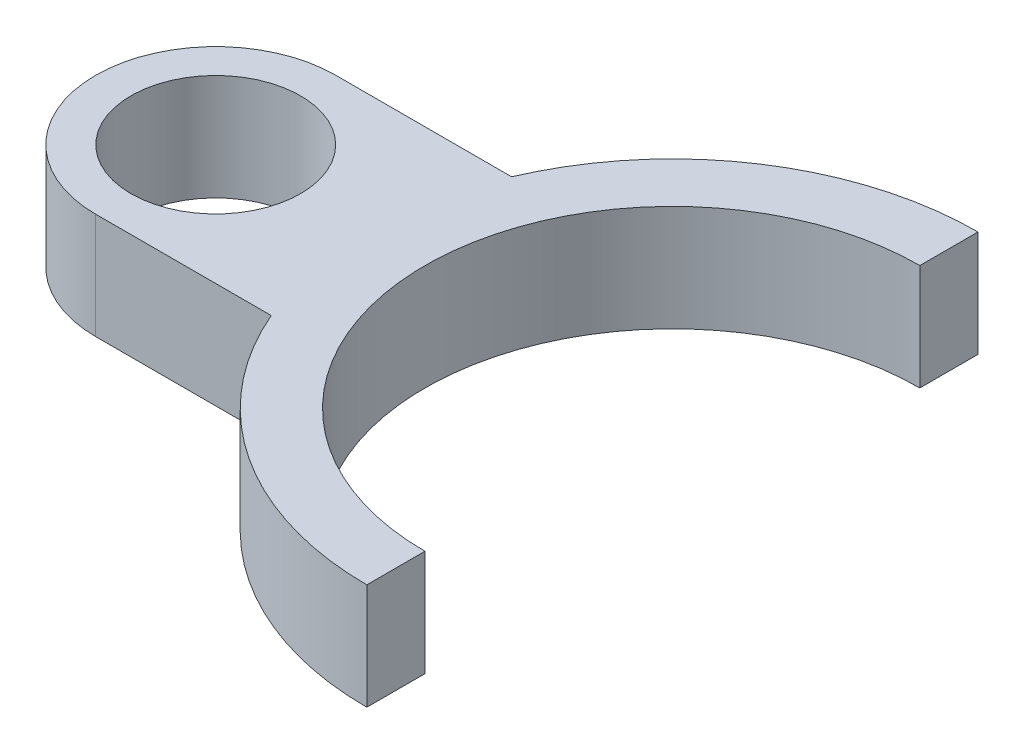
ISO-10303-21;
HEADER;
FILE_DESCRIPTION(('STEP AP214'),'2;1');
FILE_NAME('part.step','',(''),(''),'','','');
FILE_SCHEMA(('AUTOMOTIVE_DESIGN { 1 0 10303 214 1 1 1 1 }'));
ENDSEC;
DATA;
#1=APPLICATION_CONTEXT('core data for automotive mechanical design processes');
#2=APPLICATION_PROTOCOL_DEFINITION('international standard','automotive_design',2000,#1);
#3=PRODUCT_CONTEXT('',#1,'mechanical');
#4=PRODUCT('Part','Part','',(#3));
#5=PRODUCT_RELATED_PRODUCT_CATEGORY('part','',(#4));
#6=PRODUCT_DEFINITION_FORMATION('','',#4);
#7=PRODUCT_DEFINITION_CONTEXT('part definition',#1,'design');
#8=PRODUCT_DEFINITION('design','',#6,#7);
#9=PRODUCT_DEFINITION_SHAPE('','',#8);
#10=(LENGTH_UNIT() NAMED_UNIT(*) SI_UNIT(.MILLI.,.METRE.));
#11=(NAMED_UNIT(*) PLANE_ANGLE_UNIT() SI_UNIT($,.RADIAN.));
#12=(NAMED_UNIT(*) SI_UNIT($,.STERADIAN.) SOLID_ANGLE_UNIT());
#13=UNCERTAINTY_MEASURE_WITH_UNIT(LENGTH_MEASURE(1.E-05),#10,'distance_accuracy_value','');
#14=(GEOMETRIC_REPRESENTATION_CONTEXT(3) GLOBAL_UNCERTAINTY_ASSIGNED_CONTEXT((#13)) GLOBAL_UNIT_ASSIGNED_CONTEXT((#10,
#11,#12)) REPRESENTATION_CONTEXT('',''));
#15=CARTESIAN_POINT('',(0.,0.,0.));
#16=DIRECTION('',(0.,0.,1.));
#17=DIRECTION('',(1.,0.,0.));
#18=AXIS2_PLACEMENT_3D('',#15,#16,#17);
#19=CARTESIAN_POINT('',(0.,15.,0.));
#20=DIRECTION('',(0.,1.,0.));
#21=DIRECTION('',(0.,0.,1.));
#22=AXIS2_PLACEMENT_3D('',#19,#20,#21);
#23=PLANE('',#22);
#24=CARTESIAN_POINT('',(64.5980357278133,15.,0.));
#25=DIRECTION('',(0.,-1.,0.));
#26=DIRECTION('',(0.,0.,-1.));
#27=AXIS2_PLACEMENT_3D('',#24,#25,#26);
#28=CIRCLE('',#27,43.228194221237);
#29=CARTESIAN_POINT('',(24.8531759885047,15.,-17.0006735140603));
#30=VERTEX_POINT('',#29);
#31=CARTESIAN_POINT('',(64.5980357278133,15.,-43.228194221237));
#32=VERTEX_POINT('',#31);
#33=EDGE_CURVE('E130',#30,#32,#28,.T.);
#34=ORIENTED_EDGE('',*,*,#33,.F.);
#35=DIRECTION('',(-1.,0.,0.));
#36=VECTOR('',#35,1.);
#37=CARTESIAN_POINT('',(0.,15.,-17.0006735140603));
#38=LINE('',#37,#36);
#39=CARTESIAN_POINT('',(0.,15.,-17.0006735140603));
#40=VERTEX_POINT('',#39);
#41=EDGE_CURVE('E58',#30,#40,#38,.T.);
#42=ORIENTED_EDGE('',*,*,#41,.T.);
#43=CARTESIAN_POINT('',(0.,15.,0.));
#44=DIRECTION('',(0.,1.,0.));
#45=DIRECTION('',(0.,0.,1.));
#46=AXIS2_PLACEMENT_3D('',#43,#44,#45);
#47=CIRCLE('',#46,17.0006735140603);
#48=CARTESIAN_POINT('',(0.,15.,17.0006735140603));
#49=VERTEX_POINT('',#48);
#50=EDGE_CURVE('E11',#40,#49,#47,.T.);
#51=ORIENTED_EDGE('',*,*,#50,.T.);
#52=DIRECTION('',(1.,0.,0.));
#53=VECTOR('',#52,1.);
#54=CARTESIAN_POINT('',(25.,15.,17.0006735140603));
#55=LINE('',#54,#53);
#56=CARTESIAN_POINT('',(24.8531759885047,15.,17.0006735140603));
#57=VERTEX_POINT('',#56);
#58=EDGE_CURVE('E144',#49,#57,#55,.T.);
#59=ORIENTED_EDGE('',*,*,#58,.T.);
#60=CARTESIAN_POINT('',(64.5980357278133,15.,43.228194221237));
#61=VERTEX_POINT('',#60);
#62=EDGE_CURVE('E128',#61,#57,#28,.T.);
#63=ORIENTED_EDGE('',*,*,#62,.F.);
#64=DIRECTION('',(0.,0.,1.));
#65=VECTOR('',#64,1.);
#66=CARTESIAN_POINT('',(64.5980357278133,15.,0.));
#67=LINE('',#66,#65);
#68=CARTESIAN_POINT('',(64.5980357278133,15.,35.));
#69=VERTEX_POINT('',#68);
#70=EDGE_CURVE('E105',#69,#61,#67,.T.);
#71=ORIENTED_EDGE('',*,*,#70,.F.);
#72=CARTESIAN_POINT('',(64.5980357278133,15.,0.));
#73=DIRECTION('',(0.,-1.,0.));
#74=DIRECTION('',(0.,0.,-1.));
#75=AXIS2_PLACEMENT_3D('',#72,#73,#74);
#76=CIRCLE('',#75,35.);
#77=CARTESIAN_POINT('',(64.5980357278133,15.,-35.));
#78=VERTEX_POINT('',#77);
#79=EDGE_CURVE('E116',#69,#78,#76,.T.);
#80=ORIENTED_EDGE('',*,*,#79,.T.);
#81=DIRECTION('',(0.,0.,-1.));
#82=VECTOR('',#81,1.);
#83=CARTESIAN_POINT('',(64.5980357278133,15.,0.));
#84=LINE('',#83,#82);
#85=EDGE_CURVE('E112',#78,#32,#84,.T.);
#86=ORIENTED_EDGE('',*,*,#85,.T.);
#87=EDGE_LOOP('',(#34,#42,#51,#59,#63,#71,#80,#86));
#88=FACE_BOUND('',#87,.T.);
#89=CARTESIAN_POINT('',(0.,15.,0.));
#90=DIRECTION('',(0.,1.,0.));
#91=DIRECTION('',(0.,0.,1.));
#92=AXIS2_PLACEMENT_3D('',#89,#90,#91);
#93=CIRCLE('',#92,12.);
#94=CARTESIAN_POINT('',(0.,15.,12.));
#95=VERTEX_POINT('',#94);
#96=EDGE_CURVE('E164',#95,#95,#93,.T.);
#97=ORIENTED_EDGE('',*,*,#96,.F.);
#98=EDGE_LOOP('',(#97));
#99=FACE_BOUND('',#98,.T.);
#100=ADVANCED_FACE('F38',(#88,#99),#23,.T.);
#101=CARTESIAN_POINT('',(0.,0.,0.));
#102=DIRECTION('',(0.,1.,0.));
#103=DIRECTION('',(0.,0.,1.));
#104=AXIS2_PLACEMENT_3D('',#101,#102,#103);
#105=PLANE('',#104);
#106=DIRECTION('',(-1.,0.,0.));
#107=VECTOR('',#106,1.);
#108=CARTESIAN_POINT('',(0.,0.,-17.0006735140603));
#109=LINE('',#108,#107);
#110=CARTESIAN_POINT('',(24.8531759885047,0.,-17.0006735140603));
#111=VERTEX_POINT('',#110);
#112=CARTESIAN_POINT('',(0.,0.,-17.0006735140603));
#113=VERTEX_POINT('',#112);
#114=EDGE_CURVE('E154',#111,#113,#109,.T.);
#115=ORIENTED_EDGE('',*,*,#114,.F.);
#116=CARTESIAN_POINT('',(64.5980357278133,0.,0.));
#117=DIRECTION('',(0.,-1.,0.));
#118=DIRECTION('',(0.,0.,-1.));
#119=AXIS2_PLACEMENT_3D('',#116,#117,#118);
#120=CIRCLE('',#119,43.228194221237);
#121=CARTESIAN_POINT('',(64.5980357278133,0.,-43.228194221237));
#122=VERTEX_POINT('',#121);
#123=EDGE_CURVE('E140',#111,#122,#120,.T.);
#124=ORIENTED_EDGE('',*,*,#123,.T.);
#125=DIRECTION('',(0.,0.,-1.));
#126=VECTOR('',#125,1.);
#127=CARTESIAN_POINT('',(64.5980357278133,0.,0.));
#128=LINE('',#127,#126);
#129=CARTESIAN_POINT('',(64.5980357278133,0.,-35.));
#130=VERTEX_POINT('',#129);
#131=EDGE_CURVE('E121',#130,#122,#128,.T.);
#132=ORIENTED_EDGE('',*,*,#131,.F.);
#133=CARTESIAN_POINT('',(64.5980357278133,0.,0.));
#134=DIRECTION('',(0.,-1.,0.));
#135=DIRECTION('',(0.,0.,-1.));
#136=AXIS2_PLACEMENT_3D('',#133,#134,#135);
#137=CIRCLE('',#136,35.);
#138=CARTESIAN_POINT('',(64.5980357278133,0.,35.));
#139=VERTEX_POINT('',#138);
#140=EDGE_CURVE('E134',#139,#130,#137,.T.);
#141=ORIENTED_EDGE('',*,*,#140,.F.);
#142=DIRECTION('',(0.,0.,1.));
#143=VECTOR('',#142,1.);
#144=CARTESIAN_POINT('',(64.5980357278133,0.,0.));
#145=LINE('',#144,#143);
#146=CARTESIAN_POINT('',(64.5980357278133,0.,43.228194221237));
#147=VERTEX_POINT('',#146);
#148=EDGE_CURVE('E107',#139,#147,#145,.T.);
#149=ORIENTED_EDGE('',*,*,#148,.T.);
#150=CARTESIAN_POINT('',(24.8531759885047,0.,17.0006735140603));
#151=VERTEX_POINT('',#150);
#152=EDGE_CURVE('E137',#147,#151,#120,.T.);
#153=ORIENTED_EDGE('',*,*,#152,.T.);
#154=DIRECTION('',(1.,0.,0.));
#155=VECTOR('',#154,1.);
#156=CARTESIAN_POINT('',(25.,0.,17.0006735140603));
#157=LINE('',#156,#155);
#158=CARTESIAN_POINT('',(0.,0.,17.0006735140603));
#159=VERTEX_POINT('',#158);
#160=EDGE_CURVE('E152',#159,#151,#157,.T.);
#161=ORIENTED_EDGE('',*,*,#160,.F.);
#162=CARTESIAN_POINT('',(0.,0.,0.));
#163=DIRECTION('',(0.,1.,0.));
#164=DIRECTION('',(0.,0.,1.));
#165=AXIS2_PLACEMENT_3D('',#162,#163,#164);
#166=CIRCLE('',#165,17.0006735140603);
#167=EDGE_CURVE('E42',#113,#159,#166,.T.);
#168=ORIENTED_EDGE('',*,*,#167,.F.);
#169=EDGE_LOOP('',(#115,#124,#132,#141,#149,#153,#161,#168));
#170=FACE_BOUND('',#169,.T.);
#171=CARTESIAN_POINT('',(0.,0.,0.));
#172=DIRECTION('',(0.,1.,0.));
#173=DIRECTION('',(0.,0.,1.));
#174=AXIS2_PLACEMENT_3D('',#171,#172,#173);
#175=CIRCLE('',#174,12.);
#176=CARTESIAN_POINT('',(0.,0.,12.));
#177=VERTEX_POINT('',#176);
#178=EDGE_CURVE('E161',#177,#177,#175,.T.);
#179=ORIENTED_EDGE('',*,*,#178,.T.);
#180=EDGE_LOOP('',(#179));
#181=FACE_BOUND('',#180,.T.);
#182=ADVANCED_FACE('F170',(#170,#181),#105,.F.);
#183=CARTESIAN_POINT('',(0.,15.,0.));
#184=DIRECTION('',(0.,-1.,0.));
#185=DIRECTION('',(0.,0.,-1.));
#186=AXIS2_PLACEMENT_3D('',#183,#184,#185);
#187=CYLINDRICAL_SURFACE('',#186,17.0006735140603);
#188=ORIENTED_EDGE('',*,*,#50,.F.);
#189=DIRECTION('',(0.,1.,0.));
#190=VECTOR('',#189,1.);
#191=CARTESIAN_POINT('',(0.,0.,-17.0006735140603));
#192=LINE('',#191,#190);
#193=EDGE_CURVE('E159',#113,#40,#192,.T.);
#194=ORIENTED_EDGE('',*,*,#193,.F.);
#195=ORIENTED_EDGE('',*,*,#167,.T.);
#196=DIRECTION('',(0.,1.,0.));
#197=VECTOR('',#196,1.);
#198=CARTESIAN_POINT('',(0.,0.,17.0006735140603));
#199=LINE('',#198,#197);
#200=EDGE_CURVE('E156',#159,#49,#199,.T.);
#201=ORIENTED_EDGE('',*,*,#200,.T.);
#202=EDGE_LOOP('',(#188,#194,#195,#201));
#203=FACE_BOUND('',#202,.T.);
#204=ADVANCED_FACE('F40',(#203),#187,.T.);
#205=CARTESIAN_POINT('',(0.,15.,0.));
#206=DIRECTION('',(0.,-1.,0.));
#207=DIRECTION('',(0.,0.,-1.));
#208=AXIS2_PLACEMENT_3D('',#205,#206,#207);
#209=CYLINDRICAL_SURFACE('',#208,12.);
#210=ORIENTED_EDGE('',*,*,#96,.T.);
#211=EDGE_LOOP('',(#210));
#212=FACE_BOUND('',#211,.T.);
#213=ORIENTED_EDGE('',*,*,#178,.F.);
#214=EDGE_LOOP('',(#213));
#215=FACE_BOUND('',#214,.T.);
#216=ADVANCED_FACE('F172',(#212,#215),#209,.F.);
#217=CARTESIAN_POINT('',(0.,0.,-17.0006735140603));
#218=DIRECTION('',(0.,0.,-1.));
#219=DIRECTION('',(-1.,0.,0.));
#220=AXIS2_PLACEMENT_3D('',#217,#218,#219);
#221=PLANE('',#220);
#222=DIRECTION('',(0.,-1.,0.));
#223=VECTOR('',#222,1.);
#224=CARTESIAN_POINT('',(24.8531759885047,15.,-17.0006735140603));
#225=LINE('',#224,#223);
#226=EDGE_CURVE('E53',#30,#111,#225,.T.);
#227=ORIENTED_EDGE('',*,*,#226,.T.);
#228=ORIENTED_EDGE('',*,*,#114,.T.);
#229=ORIENTED_EDGE('',*,*,#193,.T.);
#230=ORIENTED_EDGE('',*,*,#41,.F.);
#231=EDGE_LOOP('',(#227,#228,#229,#230));
#232=FACE_BOUND('',#231,.T.);
#233=ADVANCED_FACE('F174',(#232),#221,.T.);
#234=CARTESIAN_POINT('',(25.,0.,17.0006735140603));
#235=DIRECTION('',(0.,0.,1.));
#236=DIRECTION('',(1.,0.,0.));
#237=AXIS2_PLACEMENT_3D('',#234,#235,#236);
#238=PLANE('',#237);
#239=DIRECTION('',(0.,-1.,0.));
#240=VECTOR('',#239,1.);
#241=CARTESIAN_POINT('',(24.8531759885047,15.,17.0006735140603));
#242=LINE('',#241,#240);
#243=EDGE_CURVE('E148',#57,#151,#242,.T.);
#244=ORIENTED_EDGE('',*,*,#243,.F.);
#245=ORIENTED_EDGE('',*,*,#58,.F.);
#246=ORIENTED_EDGE('',*,*,#200,.F.);
#247=ORIENTED_EDGE('',*,*,#160,.T.);
#248=EDGE_LOOP('',(#244,#245,#246,#247));
#249=FACE_BOUND('',#248,.T.);
#250=ADVANCED_FACE('F181',(#249),#238,.T.);
#251=CARTESIAN_POINT('',(64.5980357278133,15.,0.));
#252=DIRECTION('',(0.,-1.,0.));
#253=DIRECTION('',(0.,0.,-1.));
#254=AXIS2_PLACEMENT_3D('',#251,#252,#253);
#255=CYLINDRICAL_SURFACE('',#254,35.);
#256=ORIENTED_EDGE('',*,*,#140,.T.);
#257=DIRECTION('',(0.,-1.,0.));
#258=VECTOR('',#257,1.);
#259=CARTESIAN_POINT('',(64.5980357278133,15.,-35.));
#260=LINE('',#259,#258);
#261=EDGE_CURVE('E119',#78,#130,#260,.T.);
#262=ORIENTED_EDGE('',*,*,#261,.F.);
#263=ORIENTED_EDGE('',*,*,#79,.F.);
#264=DIRECTION('',(0.,-1.,0.));
#265=VECTOR('',#264,1.);
#266=CARTESIAN_POINT('',(64.5980357278133,15.,35.));
#267=LINE('',#266,#265);
#268=EDGE_CURVE('E101',#69,#139,#267,.T.);
#269=ORIENTED_EDGE('',*,*,#268,.T.);
#270=EDGE_LOOP('',(#256,#262,#263,#269));
#271=FACE_BOUND('',#270,.T.);
#272=ADVANCED_FACE('F117',(#271),#255,.F.);
#273=CARTESIAN_POINT('',(64.5980357278133,15.,0.));
#274=DIRECTION('',(-1.,0.,0.));
#275=DIRECTION('',(0.,0.,1.));
#276=AXIS2_PLACEMENT_3D('',#273,#274,#275);
#277=PLANE('',#276);
#278=ORIENTED_EDGE('',*,*,#131,.T.);
#279=DIRECTION('',(0.,-1.,0.));
#280=VECTOR('',#279,1.);
#281=CARTESIAN_POINT('',(64.5980357278133,15.,-43.228194221237));
#282=LINE('',#281,#280);
#283=EDGE_CURVE('E145',#32,#122,#282,.T.);
#284=ORIENTED_EDGE('',*,*,#283,.F.);
#285=ORIENTED_EDGE('',*,*,#85,.F.);
#286=ORIENTED_EDGE('',*,*,#261,.T.);
#287=EDGE_LOOP('',(#278,#284,#285,#286));
#288=FACE_BOUND('',#287,.T.);
#289=ADVANCED_FACE('F204',(#288),#277,.F.);
#290=CARTESIAN_POINT('',(64.5980357278133,15.,0.));
#291=DIRECTION('',(0.,-1.,0.));
#292=DIRECTION('',(0.,0.,-1.));
#293=AXIS2_PLACEMENT_3D('',#290,#291,#292);
#294=CYLINDRICAL_SURFACE('',#293,43.228194221237);
#295=ORIENTED_EDGE('',*,*,#123,.F.);
#296=ORIENTED_EDGE('',*,*,#226,.F.);
#297=ORIENTED_EDGE('',*,*,#33,.T.);
#298=ORIENTED_EDGE('',*,*,#283,.T.);
#299=EDGE_LOOP('',(#295,#296,#297,#298));
#300=FACE_BOUND('',#299,.T.);
#301=ADVANCED_FACE('F200',(#300),#294,.T.);
#302=ORIENTED_EDGE('',*,*,#152,.F.);
#303=DIRECTION('',(0.,-1.,0.));
#304=VECTOR('',#303,1.);
#305=CARTESIAN_POINT('',(64.5980357278133,15.,43.228194221237));
#306=LINE('',#305,#304);
#307=EDGE_CURVE('E111',#61,#147,#306,.T.);
#308=ORIENTED_EDGE('',*,*,#307,.F.);
#309=ORIENTED_EDGE('',*,*,#62,.T.);
#310=ORIENTED_EDGE('',*,*,#243,.T.);
#311=EDGE_LOOP('',(#302,#308,#309,#310));
#312=FACE_BOUND('',#311,.T.);
#313=ADVANCED_FACE('F207',(#312),#294,.T.);
#314=CARTESIAN_POINT('',(64.5980357278133,15.,0.));
#315=DIRECTION('',(1.,0.,0.));
#316=DIRECTION('',(0.,0.,-1.));
#317=AXIS2_PLACEMENT_3D('',#314,#315,#316);
#318=PLANE('',#317);
#319=ORIENTED_EDGE('',*,*,#148,.F.);
#320=ORIENTED_EDGE('',*,*,#268,.F.);
#321=ORIENTED_EDGE('',*,*,#70,.T.);
#322=ORIENTED_EDGE('',*,*,#307,.T.);
#323=EDGE_LOOP('',(#319,#320,#321,#322));
#324=FACE_BOUND('',#323,.T.);
#325=ADVANCED_FACE('F103',(#324),#318,.T.);
#326=CLOSED_SHELL('',(#100,#182,#204,#216,#233,#250,#272,#289,#301,#313,#325));
#327=MANIFOLD_SOLID_BREP('B2',#326);
#328=ADVANCED_BREP_SHAPE_REPRESENTATION('',(#18,#327),#14);
#329=SHAPE_DEFINITION_REPRESENTATION(#9,#328);
ENDSEC;
END-ISO-10303-21;
